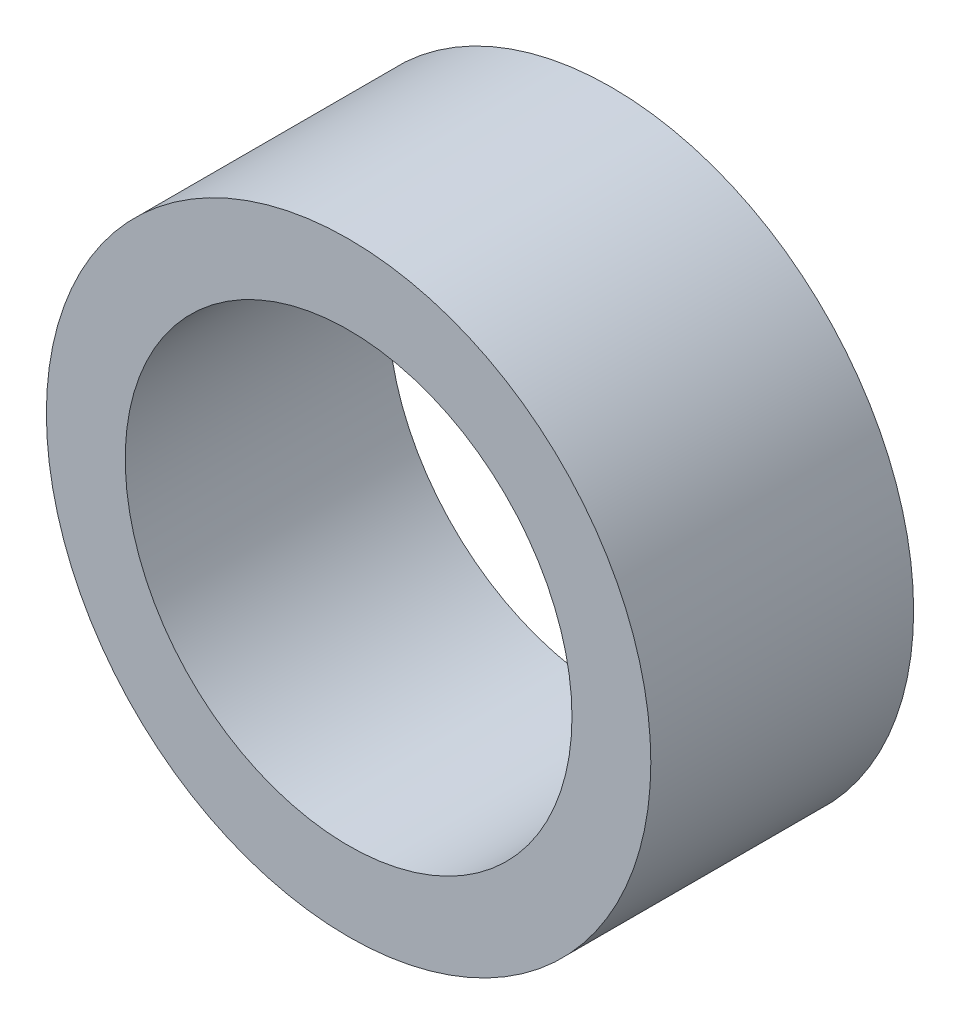
ISO-10303-21;
HEADER;
FILE_DESCRIPTION(('STEP AP214'),'2;1');
FILE_NAME('part.step','',(''),(''),'','','');
FILE_SCHEMA(('AUTOMOTIVE_DESIGN { 1 0 10303 214 1 1 1 1 }'));
ENDSEC;
DATA;
#1=APPLICATION_CONTEXT('core data for automotive mechanical design processes');
#2=APPLICATION_PROTOCOL_DEFINITION('international standard','automotive_design',2000,#1);
#3=PRODUCT_CONTEXT('',#1,'mechanical');
#4=PRODUCT('Part','Part','',(#3));
#5=PRODUCT_RELATED_PRODUCT_CATEGORY('part','',(#4));
#6=PRODUCT_DEFINITION_FORMATION('','',#4);
#7=PRODUCT_DEFINITION_CONTEXT('part definition',#1,'design');
#8=PRODUCT_DEFINITION('design','',#6,#7);
#9=PRODUCT_DEFINITION_SHAPE('','',#8);
#10=(LENGTH_UNIT() NAMED_UNIT(*) SI_UNIT(.MILLI.,.METRE.));
#11=(NAMED_UNIT(*) PLANE_ANGLE_UNIT() SI_UNIT($,.RADIAN.));
#12=(NAMED_UNIT(*) SI_UNIT($,.STERADIAN.) SOLID_ANGLE_UNIT());
#13=UNCERTAINTY_MEASURE_WITH_UNIT(LENGTH_MEASURE(1.E-05),#10,'distance_accuracy_value','');
#14=(GEOMETRIC_REPRESENTATION_CONTEXT(3) GLOBAL_UNCERTAINTY_ASSIGNED_CONTEXT((#13)) GLOBAL_UNIT_ASSIGNED_CONTEXT((#10,
#11,#12)) REPRESENTATION_CONTEXT('',''));
#15=CARTESIAN_POINT('',(0.,0.,0.));
#16=DIRECTION('',(0.,0.,1.));
#17=DIRECTION('',(1.,0.,0.));
#18=AXIS2_PLACEMENT_3D('',#15,#16,#17);
#19=CARTESIAN_POINT('',(0.,0.,-10.));
#20=DIRECTION('',(0.,0.,-1.));
#21=DIRECTION('',(1.,0.,0.));
#22=AXIS2_PLACEMENT_3D('',#19,#20,#21);
#23=PLANE('',#22);
#24=CARTESIAN_POINT('',(0.,0.,-10.));
#25=DIRECTION('',(0.,0.,1.));
#26=DIRECTION('',(1.,0.,0.));
#27=AXIS2_PLACEMENT_3D('',#24,#25,#26);
#28=CIRCLE('',#27,11.5);
#29=CARTESIAN_POINT('',(11.5,0.,-10.));
#30=VERTEX_POINT('',#29);
#31=EDGE_CURVE('E10',#30,#30,#28,.T.);
#32=ORIENTED_EDGE('',*,*,#31,.F.);
#33=EDGE_LOOP('',(#32));
#34=FACE_BOUND('',#33,.T.);
#35=CARTESIAN_POINT('',(0.,0.,-10.));
#36=DIRECTION('',(0.,0.,1.));
#37=DIRECTION('',(1.,0.,0.));
#38=AXIS2_PLACEMENT_3D('',#35,#36,#37);
#39=CIRCLE('',#38,8.5);
#40=CARTESIAN_POINT('',(8.5,0.,-10.));
#41=VERTEX_POINT('',#40);
#42=EDGE_CURVE('E56',#41,#41,#39,.T.);
#43=ORIENTED_EDGE('',*,*,#42,.T.);
#44=EDGE_LOOP('',(#43));
#45=FACE_BOUND('',#44,.T.);
#46=ADVANCED_FACE('F43',(#34,#45),#23,.T.);
#47=CARTESIAN_POINT('',(0.,0.,0.));
#48=DIRECTION('',(0.,0.,-1.));
#49=DIRECTION('',(1.,0.,0.));
#50=AXIS2_PLACEMENT_3D('',#47,#48,#49);
#51=PLANE('',#50);
#52=CARTESIAN_POINT('',(0.,0.,0.));
#53=DIRECTION('',(0.,0.,1.));
#54=DIRECTION('',(1.,0.,0.));
#55=AXIS2_PLACEMENT_3D('',#52,#53,#54);
#56=CIRCLE('',#55,11.5);
#57=CARTESIAN_POINT('',(11.5,0.,0.));
#58=VERTEX_POINT('',#57);
#59=EDGE_CURVE('E47',#58,#58,#56,.T.);
#60=ORIENTED_EDGE('',*,*,#59,.T.);
#61=EDGE_LOOP('',(#60));
#62=FACE_BOUND('',#61,.T.);
#63=CARTESIAN_POINT('',(0.,0.,0.));
#64=DIRECTION('',(0.,0.,1.));
#65=DIRECTION('',(1.,0.,0.));
#66=AXIS2_PLACEMENT_3D('',#63,#64,#65);
#67=CIRCLE('',#66,8.5);
#68=CARTESIAN_POINT('',(8.5,0.,0.));
#69=VERTEX_POINT('',#68);
#70=EDGE_CURVE('E58',#69,#69,#67,.T.);
#71=ORIENTED_EDGE('',*,*,#70,.F.);
#72=EDGE_LOOP('',(#71));
#73=FACE_BOUND('',#72,.T.);
#74=ADVANCED_FACE('F73',(#62,#73),#51,.F.);
#75=CARTESIAN_POINT('',(0.,0.,-10.));
#76=DIRECTION('',(0.,0.,1.));
#77=DIRECTION('',(-1.,0.,0.));
#78=AXIS2_PLACEMENT_3D('',#75,#76,#77);
#79=CYLINDRICAL_SURFACE('',#78,11.5);
#80=ORIENTED_EDGE('',*,*,#31,.T.);
#81=EDGE_LOOP('',(#80));
#82=FACE_BOUND('',#81,.T.);
#83=ORIENTED_EDGE('',*,*,#59,.F.);
#84=EDGE_LOOP('',(#83));
#85=FACE_BOUND('',#84,.T.);
#86=ADVANCED_FACE('F45',(#82,#85),#79,.T.);
#87=CARTESIAN_POINT('',(0.,0.,-10.));
#88=DIRECTION('',(0.,0.,1.));
#89=DIRECTION('',(-1.,0.,0.));
#90=AXIS2_PLACEMENT_3D('',#87,#88,#89);
#91=CYLINDRICAL_SURFACE('',#90,8.5);
#92=ORIENTED_EDGE('',*,*,#42,.F.);
#93=EDGE_LOOP('',(#92));
#94=FACE_BOUND('',#93,.T.);
#95=ORIENTED_EDGE('',*,*,#70,.T.);
#96=EDGE_LOOP('',(#95));
#97=FACE_BOUND('',#96,.T.);
#98=ADVANCED_FACE('F67',(#94,#97),#91,.F.);
#99=CLOSED_SHELL('',(#46,#74,#86,#98));
#100=MANIFOLD_SOLID_BREP('B2',#99);
#101=ADVANCED_BREP_SHAPE_REPRESENTATION('',(#18,#100),#14);
#102=SHAPE_DEFINITION_REPRESENTATION(#9,#101);
ENDSEC;
END-ISO-10303-21;
